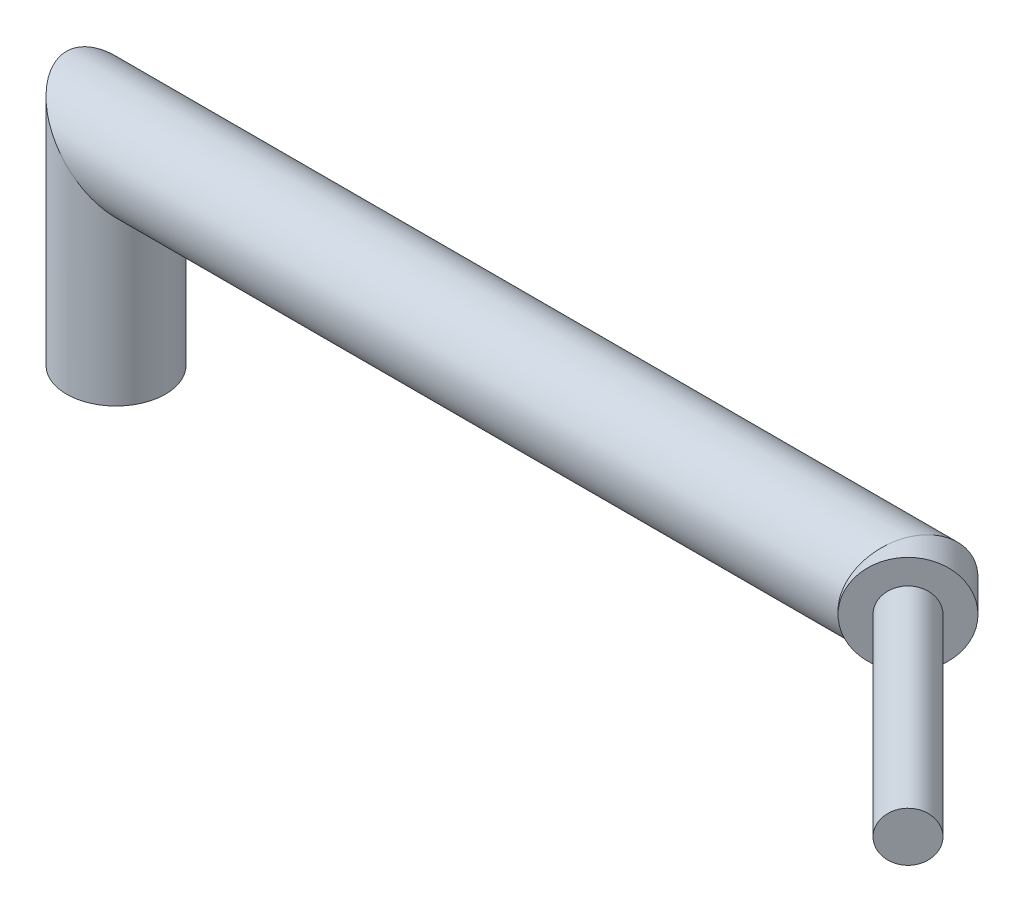
ISO-10303-21;
HEADER;
FILE_DESCRIPTION(('STEP AP214'),'2;1');
FILE_NAME('part.step','',(''),(''),'','','');
FILE_SCHEMA(('AUTOMOTIVE_DESIGN { 1 0 10303 214 1 1 1 1 }'));
ENDSEC;
DATA;
#1=APPLICATION_CONTEXT('core data for automotive mechanical design processes');
#2=APPLICATION_PROTOCOL_DEFINITION('international standard','automotive_design',2000,#1);
#3=PRODUCT_CONTEXT('',#1,'mechanical');
#4=PRODUCT('Part','Part','',(#3));
#5=PRODUCT_RELATED_PRODUCT_CATEGORY('part','',(#4));
#6=PRODUCT_DEFINITION_FORMATION('','',#4);
#7=PRODUCT_DEFINITION_CONTEXT('part definition',#1,'design');
#8=PRODUCT_DEFINITION('design','',#6,#7);
#9=PRODUCT_DEFINITION_SHAPE('','',#8);
#10=(LENGTH_UNIT() NAMED_UNIT(*) SI_UNIT(.MILLI.,.METRE.));
#11=(NAMED_UNIT(*) PLANE_ANGLE_UNIT() SI_UNIT($,.RADIAN.));
#12=(NAMED_UNIT(*) SI_UNIT($,.STERADIAN.) SOLID_ANGLE_UNIT());
#13=UNCERTAINTY_MEASURE_WITH_UNIT(LENGTH_MEASURE(1.E-05),#10,'distance_accuracy_value','');
#14=(GEOMETRIC_REPRESENTATION_CONTEXT(3) GLOBAL_UNCERTAINTY_ASSIGNED_CONTEXT((#13)) GLOBAL_UNIT_ASSIGNED_CONTEXT((#10,
#11,#12)) REPRESENTATION_CONTEXT('',''));
#15=CARTESIAN_POINT('',(0.,0.,0.));
#16=DIRECTION('',(0.,0.,1.));
#17=DIRECTION('',(1.,0.,0.));
#18=AXIS2_PLACEMENT_3D('',#15,#16,#17);
#19=CARTESIAN_POINT('',(156.707463914933,40.,-3.29253608506665));
#20=DIRECTION('',(0.707106781186546,0.,0.707106781186549));
#21=DIRECTION('',(-0.707106781186549,0.,0.707106781186546));
#22=AXIS2_PLACEMENT_3D('',#19,#20,#21);
#23=CYLINDRICAL_SURFACE('',#22,10.);
#24=CARTESIAN_POINT('',(160.,40.,0.));
#25=DIRECTION('',(-0.923879532511286,0.,-0.382683432365091));
#26=DIRECTION('',(0.382683432365091,0.,-0.923879532511286));
#27=AXIS2_PLACEMENT_3D('',#24,#25,#26);
#28=ELLIPSE('',#27,10.823922002924,10.);
#29=CARTESIAN_POINT('',(164.142135623731,40.,-9.99999999999999));
#30=VERTEX_POINT('',#29);
#31=EDGE_CURVE('E43',#30,#30,#28,.T.);
#32=ORIENTED_EDGE('',*,*,#31,.F.);
#33=EDGE_LOOP('',(#32));
#34=FACE_BOUND('',#33,.T.);
#35=CARTESIAN_POINT('',(163.535533905933,40.,3.53553390593275));
#36=DIRECTION('',(0.707106781186546,0.,0.707106781186549));
#37=DIRECTION('',(0.707106781186549,0.,-0.707106781186546));
#38=AXIS2_PLACEMENT_3D('',#35,#36,#37);
#39=CIRCLE('',#38,10.);
#40=CARTESIAN_POINT('',(170.606601717798,40.,-3.53553390593271));
#41=VERTEX_POINT('',#40);
#42=EDGE_CURVE('E102',#41,#41,#39,.T.);
#43=ORIENTED_EDGE('',*,*,#42,.F.);
#44=EDGE_LOOP('',(#43));
#45=FACE_BOUND('',#44,.T.);
#46=ADVANCED_FACE('F39',(#34,#45),#23,.T.);
#47=CARTESIAN_POINT('',(0.,0.,0.));
#48=DIRECTION('',(0.,-1.,0.));
#49=DIRECTION('',(0.,0.,-1.));
#50=AXIS2_PLACEMENT_3D('',#47,#48,#49);
#51=PLANE('',#50);
#52=CARTESIAN_POINT('',(0.,0.,0.));
#53=DIRECTION('',(0.,-1.,0.));
#54=DIRECTION('',(0.,0.,-1.));
#55=AXIS2_PLACEMENT_3D('',#52,#53,#54);
#56=CIRCLE('',#55,8.00000000000001);
#57=CARTESIAN_POINT('',(0.,0.,-7.99999999999999));
#58=VERTEX_POINT('',#57);
#59=EDGE_CURVE('E84',#58,#58,#56,.F.);
#60=ORIENTED_EDGE('',*,*,#59,.T.);
#61=EDGE_LOOP('',(#60));
#62=FACE_BOUND('',#61,.T.);
#63=CARTESIAN_POINT('',(0.,0.,0.));
#64=DIRECTION('',(0.,1.,0.));
#65=DIRECTION('',(0.,0.,-1.));
#66=AXIS2_PLACEMENT_3D('',#63,#64,#65);
#67=CIRCLE('',#66,10.);
#68=CARTESIAN_POINT('',(0.,0.,-9.99999999999999));
#69=VERTEX_POINT('',#68);
#70=EDGE_CURVE('E48',#69,#69,#67,.T.);
#71=ORIENTED_EDGE('',*,*,#70,.F.);
#72=EDGE_LOOP('',(#71));
#73=FACE_BOUND('',#72,.T.);
#74=ADVANCED_FACE('F125',(#62,#73),#51,.T.);
#75=CARTESIAN_POINT('',(-22.1,40.,0.));
#76=DIRECTION('',(1.,0.,0.));
#77=DIRECTION('',(0.,0.,1.));
#78=AXIS2_PLACEMENT_3D('',#75,#76,#77);
#79=CYLINDRICAL_SURFACE('',#78,10.);
#80=CARTESIAN_POINT('',(0.,40.,0.));
#81=DIRECTION('',(-0.707106781186548,-0.707106781186548,0.));
#82=DIRECTION('',(-0.707106781186548,0.707106781186548,0.));
#83=AXIS2_PLACEMENT_3D('',#80,#81,#82);
#84=ELLIPSE('',#83,14.142135623731,10.);
#85=CARTESIAN_POINT('',(-10.,50.,0.));
#86=VERTEX_POINT('',#85);
#87=EDGE_CURVE('E12',#86,#86,#84,.T.);
#88=ORIENTED_EDGE('',*,*,#87,.F.);
#89=EDGE_LOOP('',(#88));
#90=FACE_BOUND('',#89,.T.);
#91=ORIENTED_EDGE('',*,*,#31,.T.);
#92=EDGE_LOOP('',(#91));
#93=FACE_BOUND('',#92,.T.);
#94=ADVANCED_FACE('F122',(#90,#93),#79,.T.);
#95=CARTESIAN_POINT('',(0.,0.,0.));
#96=DIRECTION('',(0.,1.,0.));
#97=DIRECTION('',(0.,0.,-1.));
#98=AXIS2_PLACEMENT_3D('',#95,#96,#97);
#99=CYLINDRICAL_SURFACE('',#98,10.);
#100=ORIENTED_EDGE('',*,*,#70,.T.);
#101=EDGE_LOOP('',(#100));
#102=FACE_BOUND('',#101,.T.);
#103=ORIENTED_EDGE('',*,*,#87,.T.);
#104=EDGE_LOOP('',(#103));
#105=FACE_BOUND('',#104,.T.);
#106=ADVANCED_FACE('F113',(#102,#105),#99,.T.);
#107=CARTESIAN_POINT('',(163.535533905933,40.,3.53553390593274));
#108=DIRECTION('',(0.707106781186546,0.,0.707106781186549));
#109=DIRECTION('',(0.707106781186549,0.,-0.707106781186546));
#110=AXIS2_PLACEMENT_3D('',#107,#108,#109);
#111=CYLINDRICAL_SURFACE('',#110,5.00000000000004);
#112=CARTESIAN_POINT('',(163.535533905933,40.,3.53553390593274));
#113=DIRECTION('',(0.707106781186546,0.,0.707106781186549));
#114=DIRECTION('',(0.707106781186549,0.,-0.707106781186546));
#115=AXIS2_PLACEMENT_3D('',#112,#113,#114);
#116=CIRCLE('',#115,5.00000000000004);
#117=CARTESIAN_POINT('',(167.071067811865,40.,0.));
#118=VERTEX_POINT('',#117);
#119=EDGE_CURVE('E99',#118,#118,#116,.T.);
#120=ORIENTED_EDGE('',*,*,#119,.T.);
#121=EDGE_LOOP('',(#120));
#122=FACE_BOUND('',#121,.T.);
#123=CARTESIAN_POINT('',(202.426406871193,40.,42.4264068711929));
#124=DIRECTION('',(0.707106781186546,0.,0.707106781186549));
#125=DIRECTION('',(0.707106781186549,0.,-0.707106781186546));
#126=AXIS2_PLACEMENT_3D('',#123,#124,#125);
#127=CIRCLE('',#126,5.00000000000004);
#128=CARTESIAN_POINT('',(205.961940777125,40.,38.8908729652602));
#129=VERTEX_POINT('',#128);
#130=EDGE_CURVE('E98',#129,#129,#127,.T.);
#131=ORIENTED_EDGE('',*,*,#130,.F.);
#132=EDGE_LOOP('',(#131));
#133=FACE_BOUND('',#132,.T.);
#134=ADVANCED_FACE('F110',(#122,#133),#111,.T.);
#135=CARTESIAN_POINT('',(83.5355339059323,0.,83.5355339059327));
#136=DIRECTION('',(0.707106781186546,0.,0.707106781186549));
#137=DIRECTION('',(0.707106781186549,0.,-0.707106781186546));
#138=AXIS2_PLACEMENT_3D('',#135,#136,#137);
#139=PLANE('',#138);
#140=ORIENTED_EDGE('',*,*,#119,.F.);
#141=EDGE_LOOP('',(#140));
#142=FACE_BOUND('',#141,.T.);
#143=ORIENTED_EDGE('',*,*,#42,.T.);
#144=EDGE_LOOP('',(#143));
#145=FACE_BOUND('',#144,.T.);
#146=ADVANCED_FACE('F112',(#142,#145),#139,.T.);
#147=CARTESIAN_POINT('',(202.426406871193,40.,42.426406871193));
#148=DIRECTION('',(-0.707106781186546,0.,-0.707106781186549));
#149=DIRECTION('',(0.707106781186549,0.,-0.707106781186546));
#150=AXIS2_PLACEMENT_3D('',#147,#148,#149);
#151=PLANE('',#150);
#152=ORIENTED_EDGE('',*,*,#130,.T.);
#153=EDGE_LOOP('',(#152));
#154=FACE_BOUND('',#153,.T.);
#155=ADVANCED_FACE('F41',(#154),#151,.F.);
#156=CARTESIAN_POINT('',(156.707463914933,40.,-3.29253608506665));
#157=DIRECTION('',(0.707106781186546,0.,0.707106781186549));
#158=DIRECTION('',(-0.707106781186549,0.,0.707106781186546));
#159=AXIS2_PLACEMENT_3D('',#156,#157,#158);
#160=CYLINDRICAL_SURFACE('',#159,8.00000000000001);
#161=CARTESIAN_POINT('',(160.,40.,0.));
#162=DIRECTION('',(0.923879532511286,0.,0.382683432365091));
#163=DIRECTION('',(-0.382683432365091,0.,0.923879532511286));
#164=AXIS2_PLACEMENT_3D('',#161,#162,#163);
#165=ELLIPSE('',#164,8.65913760233916,8.00000000000001);
#166=CARTESIAN_POINT('',(157.,43.3976691830264,7.2426406871191));
#167=VERTEX_POINT('',#166);
#168=CARTESIAN_POINT('',(160.,48.,0.));
#169=VERTEX_POINT('',#168);
#170=EDGE_CURVE('E76',#167,#169,#165,.F.);
#171=ORIENTED_EDGE('',*,*,#170,.T.);
#172=CARTESIAN_POINT('',(157.,36.6023308169736,7.2426406871191));
#173=VERTEX_POINT('',#172);
#174=EDGE_CURVE('E73',#169,#173,#165,.F.);
#175=ORIENTED_EDGE('',*,*,#174,.T.);
#176=CARTESIAN_POINT('',(162.12132034356,40.,2.12132034355962));
#177=DIRECTION('',(0.707106781186546,0.,0.707106781186549));
#178=DIRECTION('',(0.707106781186549,0.,-0.707106781186546));
#179=AXIS2_PLACEMENT_3D('',#176,#177,#178);
#180=CIRCLE('',#179,8.00000000000001);
#181=EDGE_CURVE('E81',#173,#167,#180,.T.);
#182=ORIENTED_EDGE('',*,*,#181,.T.);
#183=EDGE_LOOP('',(#171,#175,#182));
#184=FACE_BOUND('',#183,.T.);
#185=ADVANCED_FACE('F83',(#184),#160,.F.);
#186=CARTESIAN_POINT('',(-22.1,40.,0.));
#187=DIRECTION('',(1.,0.,0.));
#188=DIRECTION('',(0.,0.,1.));
#189=AXIS2_PLACEMENT_3D('',#186,#187,#188);
#190=CYLINDRICAL_SURFACE('',#189,8.00000000000001);
#191=CARTESIAN_POINT('',(0.,40.,0.));
#192=DIRECTION('',(0.707106781186547,0.707106781186547,0.));
#193=DIRECTION('',(0.707106781186547,-0.707106781186547,0.));
#194=AXIS2_PLACEMENT_3D('',#191,#192,#193);
#195=ELLIPSE('',#194,11.3137084989848,8.00000000000001);
#196=CARTESIAN_POINT('',(0.,40.,8.00000000000002));
#197=VERTEX_POINT('',#196);
#198=EDGE_CURVE('E86',#197,#197,#195,.F.);
#199=ORIENTED_EDGE('',*,*,#198,.T.);
#200=EDGE_LOOP('',(#199));
#201=FACE_BOUND('',#200,.T.);
#202=ORIENTED_EDGE('',*,*,#170,.F.);
#203=CARTESIAN_POINT('',(164.242640687119,40.,0.));
#204=DIRECTION('',(0.707106781186546,0.,0.707106781186549));
#205=DIRECTION('',(0.707106781186549,0.,-0.707106781186546));
#206=AXIS2_PLACEMENT_3D('',#203,#204,#205);
#207=ELLIPSE('',#206,11.3137084989848,8.00000000000001);
#208=EDGE_CURVE('E77',#173,#167,#207,.F.);
#209=ORIENTED_EDGE('',*,*,#208,.F.);
#210=ORIENTED_EDGE('',*,*,#174,.F.);
#211=EDGE_LOOP('',(#202,#209,#210));
#212=FACE_BOUND('',#211,.T.);
#213=ADVANCED_FACE('F75',(#201,#212),#190,.F.);
#214=CARTESIAN_POINT('',(0.,0.,0.));
#215=DIRECTION('',(0.,1.,0.));
#216=DIRECTION('',(0.,0.,-1.));
#217=AXIS2_PLACEMENT_3D('',#214,#215,#216);
#218=CYLINDRICAL_SURFACE('',#217,8.00000000000001);
#219=ORIENTED_EDGE('',*,*,#59,.F.);
#220=EDGE_LOOP('',(#219));
#221=FACE_BOUND('',#220,.T.);
#222=ORIENTED_EDGE('',*,*,#198,.F.);
#223=EDGE_LOOP('',(#222));
#224=FACE_BOUND('',#223,.T.);
#225=ADVANCED_FACE('F184',(#221,#224),#218,.F.);
#226=CARTESIAN_POINT('',(163.535533905933,40.,3.53553390593274));
#227=DIRECTION('',(0.707106781186546,0.,0.707106781186549));
#228=DIRECTION('',(0.707106781186549,0.,-0.707106781186546));
#229=AXIS2_PLACEMENT_3D('',#226,#227,#228);
#230=CYLINDRICAL_SURFACE('',#229,3.00000000000004);
#231=CARTESIAN_POINT('',(162.12132034356,40.,2.12132034355963));
#232=DIRECTION('',(0.707106781186546,0.,0.707106781186549));
#233=DIRECTION('',(0.707106781186549,0.,-0.707106781186546));
#234=AXIS2_PLACEMENT_3D('',#231,#232,#233);
#235=CIRCLE('',#234,3.00000000000004);
#236=CARTESIAN_POINT('',(164.242640687119,40.,0.));
#237=VERTEX_POINT('',#236);
#238=EDGE_CURVE('E90',#237,#237,#235,.T.);
#239=ORIENTED_EDGE('',*,*,#238,.F.);
#240=EDGE_LOOP('',(#239));
#241=FACE_BOUND('',#240,.T.);
#242=CARTESIAN_POINT('',(201.01219330882,40.,41.0121933088199));
#243=DIRECTION('',(-0.707106781186546,0.,-0.707106781186549));
#244=DIRECTION('',(-0.707106781186549,0.,0.707106781186546));
#245=AXIS2_PLACEMENT_3D('',#242,#243,#244);
#246=CIRCLE('',#245,3.00000000000004);
#247=CARTESIAN_POINT('',(198.89087296526,40.,43.1335136523795));
#248=VERTEX_POINT('',#247);
#249=EDGE_CURVE('E94',#248,#248,#246,.F.);
#250=ORIENTED_EDGE('',*,*,#249,.T.);
#251=EDGE_LOOP('',(#250));
#252=FACE_BOUND('',#251,.T.);
#253=ADVANCED_FACE('F193',(#241,#252),#230,.F.);
#254=CARTESIAN_POINT('',(82.1213203435592,0.,82.1213203435596));
#255=DIRECTION('',(0.707106781186546,0.,0.707106781186549));
#256=DIRECTION('',(0.707106781186549,0.,-0.707106781186546));
#257=AXIS2_PLACEMENT_3D('',#254,#255,#256);
#258=PLANE('',#257);
#259=ORIENTED_EDGE('',*,*,#238,.T.);
#260=EDGE_LOOP('',(#259));
#261=FACE_BOUND('',#260,.T.);
#262=ORIENTED_EDGE('',*,*,#181,.F.);
#263=ORIENTED_EDGE('',*,*,#208,.T.);
#264=EDGE_LOOP('',(#262,#263));
#265=FACE_BOUND('',#264,.T.);
#266=ADVANCED_FACE('F202',(#261,#265),#258,.F.);
#267=CARTESIAN_POINT('',(201.01219330882,40.,41.0121933088199));
#268=DIRECTION('',(-0.707106781186546,0.,-0.707106781186549));
#269=DIRECTION('',(0.707106781186549,0.,-0.707106781186546));
#270=AXIS2_PLACEMENT_3D('',#267,#268,#269);
#271=PLANE('',#270);
#272=ORIENTED_EDGE('',*,*,#249,.F.);
#273=EDGE_LOOP('',(#272));
#274=FACE_BOUND('',#273,.T.);
#275=ADVANCED_FACE('F211',(#274),#271,.T.);
#276=CLOSED_SHELL('',(#46,#74,#94,#106,#134,#146,#155,#185,#213,#225,#253,#266,#275));
#277=MANIFOLD_SOLID_BREP('B2',#276);
#278=ADVANCED_BREP_SHAPE_REPRESENTATION('',(#18,#277),#14);
#279=SHAPE_DEFINITION_REPRESENTATION(#9,#278);
ENDSEC;
END-ISO-10303-21;
